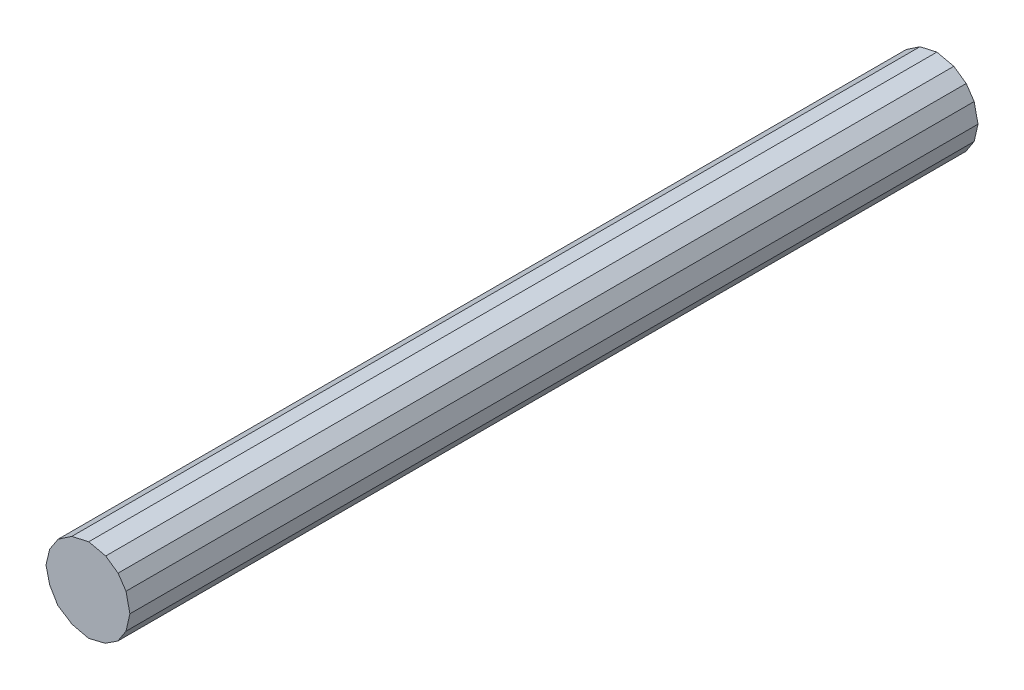
ISO-10303-21;
HEADER;
FILE_DESCRIPTION(('STEP AP214'),'2;1');
FILE_NAME('part.step','',(''),(''),'','','');
FILE_SCHEMA(('AUTOMOTIVE_DESIGN { 1 0 10303 214 1 1 1 1 }'));
ENDSEC;
DATA;
#1=APPLICATION_CONTEXT('core data for automotive mechanical design processes');
#2=APPLICATION_PROTOCOL_DEFINITION('international standard','automotive_design',2000,#1);
#3=PRODUCT_CONTEXT('',#1,'mechanical');
#4=PRODUCT('Part','Part','',(#3));
#5=PRODUCT_RELATED_PRODUCT_CATEGORY('part','',(#4));
#6=PRODUCT_DEFINITION_FORMATION('','',#4);
#7=PRODUCT_DEFINITION_CONTEXT('part definition',#1,'design');
#8=PRODUCT_DEFINITION('design','',#6,#7);
#9=PRODUCT_DEFINITION_SHAPE('','',#8);
#10=(LENGTH_UNIT() NAMED_UNIT(*) SI_UNIT(.MILLI.,.METRE.));
#11=(NAMED_UNIT(*) PLANE_ANGLE_UNIT() SI_UNIT($,.RADIAN.));
#12=(NAMED_UNIT(*) SI_UNIT($,.STERADIAN.) SOLID_ANGLE_UNIT());
#13=UNCERTAINTY_MEASURE_WITH_UNIT(LENGTH_MEASURE(1.E-05),#10,'distance_accuracy_value','');
#14=(GEOMETRIC_REPRESENTATION_CONTEXT(3) GLOBAL_UNCERTAINTY_ASSIGNED_CONTEXT((#13)) GLOBAL_UNIT_ASSIGNED_CONTEXT((#10,
#11,#12)) REPRESENTATION_CONTEXT('',''));
#15=CARTESIAN_POINT('',(0.,0.,0.));
#16=DIRECTION('',(0.,0.,1.));
#17=DIRECTION('',(1.,0.,0.));
#18=AXIS2_PLACEMENT_3D('',#15,#16,#17);
#19=CARTESIAN_POINT('',(-0.5050663,-0.1985264,11.20000046));
#20=DIRECTION('',(0.,0.,1.));
#21=DIRECTION('',(1.,0.,0.));
#22=AXIS2_PLACEMENT_3D('',#19,#20,#21);
#23=PLANE('',#22);
#24=DIRECTION('',(-0.231653218119011,0.972798430578044,0.));
#25=VECTOR('',#24,1.);
#26=CARTESIAN_POINT('',(-0.5050663,-0.1985264,11.20000046));
#27=LINE('',#26,#25);
#28=CARTESIAN_POINT('',(-0.5050663,-0.1985264,11.20000046));
#29=VERTEX_POINT('',#28);
#30=CARTESIAN_POINT('',(-0.5537327,0.005841999999999,11.20000046));
#31=VERTEX_POINT('',#30);
#32=EDGE_CURVE('E224',#29,#31,#27,.T.);
#33=ORIENTED_EDGE('',*,*,#32,.F.);
#34=DIRECTION('',(-0.508961233063914,0.860789441871855,0.));
#35=VECTOR('',#34,1.);
#36=CARTESIAN_POINT('',(-0.3980307,-0.3795522,11.20000046));
#37=LINE('',#36,#35);
#38=CARTESIAN_POINT('',(-0.3980307,-0.3795522,11.20000046));
#39=VERTEX_POINT('',#38);
#40=EDGE_CURVE('E27',#39,#29,#37,.T.);
#41=ORIENTED_EDGE('',*,*,#40,.F.);
#42=DIRECTION('',(-0.842148036657239,0.539246404118153,0.));
#43=VECTOR('',#42,1.);
#44=CARTESIAN_POINT('',(-0.2248027,-0.490474,11.20000046));
#45=LINE('',#44,#43);
#46=CARTESIAN_POINT('',(-0.2248027,-0.490474,11.20000046));
#47=VERTEX_POINT('',#46);
#48=EDGE_CURVE('E109',#47,#39,#45,.T.);
#49=ORIENTED_EDGE('',*,*,#48,.F.);
#50=DIRECTION('',(-0.707106781186548,0.707106781186548,0.));
#51=VECTOR('',#50,1.);
#52=CARTESIAN_POINT('',(-0.2150491,-0.5002276,11.20000046));
#53=LINE('',#52,#51);
#54=CARTESIAN_POINT('',(-0.2150491,-0.5002276,11.20000046));
#55=VERTEX_POINT('',#54);
#56=EDGE_CURVE('E21',#55,#47,#53,.T.);
#57=ORIENTED_EDGE('',*,*,#56,.F.);
#58=DIRECTION('',(-0.973544536039774,0.228497344288947,0.));
#59=VECTOR('',#58,1.);
#60=CARTESIAN_POINT('',(0.0087503,-0.5527548,11.20000046));
#61=LINE('',#60,#59);
#62=CARTESIAN_POINT('',(0.0087503,-0.5527548,11.20000046));
#63=VERTEX_POINT('',#62);
#64=EDGE_CURVE('E230',#63,#55,#61,.T.);
#65=ORIENTED_EDGE('',*,*,#64,.F.);
#66=DIRECTION('',(-0.972173014602938,-0.234264017035985,0.));
#67=VECTOR('',#66,1.);
#68=CARTESIAN_POINT('',(0.2267331,-0.5002276,11.20000046));
#69=LINE('',#68,#67);
#70=CARTESIAN_POINT('',(0.2267331,-0.5002276,11.20000046));
#71=VERTEX_POINT('',#70);
#72=EDGE_CURVE('E249',#71,#63,#69,.T.);
#73=ORIENTED_EDGE('',*,*,#72,.F.);
#74=DIRECTION('',(-0.837987268129986,-0.545689782249991,0.));
#75=VECTOR('',#74,1.);
#76=CARTESIAN_POINT('',(0.3941445,-0.3912108,11.20000046));
#77=LINE('',#76,#75);
#78=CARTESIAN_POINT('',(0.3941445,-0.3912108,11.20000046));
#79=VERTEX_POINT('',#78);
#80=EDGE_CURVE('E259',#79,#71,#77,.T.);
#81=ORIENTED_EDGE('',*,*,#80,.F.);
#82=DIRECTION('',(-0.545658634243012,-0.838007550608019,0.));
#83=VECTOR('',#82,1.);
#84=CARTESIAN_POINT('',(0.5031359,-0.2238248,11.20000046));
#85=LINE('',#84,#83);
#86=CARTESIAN_POINT('',(0.5031359,-0.2238248,11.20000046));
#87=VERTEX_POINT('',#86);
#88=EDGE_CURVE('E235',#87,#79,#85,.T.);
#89=ORIENTED_EDGE('',*,*,#88,.F.);
#90=DIRECTION('',(-0.220491886816933,-0.975388808551702,0.));
#91=VECTOR('',#90,1.);
#92=CARTESIAN_POINT('',(0.5537327,0.,11.20000046));
#93=LINE('',#92,#91);
#94=CARTESIAN_POINT('',(0.5537327,0.,11.20000046));
#95=VERTEX_POINT('',#94);
#96=EDGE_CURVE('E218',#95,#87,#93,.T.);
#97=ORIENTED_EDGE('',*,*,#96,.F.);
#98=DIRECTION('',(0.211727966137,-0.977328638870001,0.));
#99=VECTOR('',#98,1.);
#100=CARTESIAN_POINT('',(0.5031359,0.233553,11.20000046));
#101=LINE('',#100,#99);
#102=CARTESIAN_POINT('',(0.5031359,0.233553,11.20000046));
#103=VERTEX_POINT('',#102);
#104=EDGE_CURVE('E164',#103,#95,#101,.T.);
#105=ORIENTED_EDGE('',*,*,#104,.F.);
#106=DIRECTION('',(0.564292757689139,-0.825574759558204,0.));
#107=VECTOR('',#106,1.);
#108=CARTESIAN_POINT('',(0.3980307,0.3873246,11.20000046));
#109=LINE('',#108,#107);
#110=CARTESIAN_POINT('',(0.3980307,0.3873246,11.20000046));
#111=VERTEX_POINT('',#110);
#112=EDGE_CURVE('E159',#111,#103,#109,.T.);
#113=ORIENTED_EDGE('',*,*,#112,.F.);
#114=DIRECTION('',(0.818329059800928,-0.57474998902595,0.));
#115=VECTOR('',#114,1.);
#116=CARTESIAN_POINT('',(0.2345309,0.502158,11.20000046));
#117=LINE('',#116,#115);
#118=CARTESIAN_POINT('',(0.2345309,0.502158,11.20000046));
#119=VERTEX_POINT('',#118);
#120=EDGE_CURVE('E162',#119,#111,#117,.T.);
#121=ORIENTED_EDGE('',*,*,#120,.F.);
#122=DIRECTION('',(0.975388808551702,-0.220491886816933,0.));
#123=VECTOR('',#122,1.);
#124=CARTESIAN_POINT('',(0.0107061,0.5527548,11.20000046));
#125=LINE('',#124,#123);
#126=CARTESIAN_POINT('',(0.0107061,0.5527548,11.20000046));
#127=VERTEX_POINT('',#126);
#128=EDGE_CURVE('E208',#127,#119,#125,.T.);
#129=ORIENTED_EDGE('',*,*,#128,.F.);
#130=DIRECTION('',(0.975388808551702,0.220491886816933,0.));
#131=VECTOR('',#130,1.);
#132=CARTESIAN_POINT('',(-0.2131187,0.502158,11.20000046));
#133=LINE('',#132,#131);
#134=CARTESIAN_POINT('',(-0.2131187,0.502158,11.20000046));
#135=VERTEX_POINT('',#134);
#136=EDGE_CURVE('E264',#135,#127,#133,.T.);
#137=ORIENTED_EDGE('',*,*,#136,.F.);
#138=DIRECTION('',(0.827880404697028,0.560904658136019,0.));
#139=VECTOR('',#138,1.);
#140=CARTESIAN_POINT('',(-0.3941191,0.3795268,11.20000046));
#141=LINE('',#140,#139);
#142=CARTESIAN_POINT('',(-0.3941191,0.3795268,11.20000046));
#143=VERTEX_POINT('',#142);
#144=EDGE_CURVE('E244',#143,#135,#141,.T.);
#145=ORIENTED_EDGE('',*,*,#144,.F.);
#146=DIRECTION('',(0.548080747546029,0.836425426544044,0.));
#147=VECTOR('',#146,1.);
#148=CARTESIAN_POINT('',(-0.5050663,0.2102104,11.20000046));
#149=LINE('',#148,#147);
#150=CARTESIAN_POINT('',(-0.5050663,0.2102104,11.20000046));
#151=VERTEX_POINT('',#150);
#152=EDGE_CURVE('E191',#151,#143,#149,.T.);
#153=ORIENTED_EDGE('',*,*,#152,.F.);
#154=DIRECTION('',(0.231653218119011,0.972798430578044,0.));
#155=VECTOR('',#154,1.);
#156=CARTESIAN_POINT('',(-0.5537327,0.005841999999999,11.20000046));
#157=LINE('',#156,#155);
#158=EDGE_CURVE('E197',#31,#151,#157,.T.);
#159=ORIENTED_EDGE('',*,*,#158,.F.);
#160=EDGE_LOOP('',(#33,#41,#49,#57,#65,#73,#81,#89,#97,#105,#113,#121,#129,#137,#145,#153,#159));
#161=FACE_BOUND('',#160,.T.);
#162=ADVANCED_FACE('F17',(#161),#23,.T.);
#163=CARTESIAN_POINT('',(-0.5050663,-0.1985264,0.));
#164=DIRECTION('',(0.,0.,1.));
#165=DIRECTION('',(1.,0.,0.));
#166=AXIS2_PLACEMENT_3D('',#163,#164,#165);
#167=PLANE('',#166);
#168=DIRECTION('',(-0.231653218119011,0.972798430578044,0.));
#169=VECTOR('',#168,1.);
#170=CARTESIAN_POINT('',(-0.5050663,-0.1985264,0.));
#171=LINE('',#170,#169);
#172=CARTESIAN_POINT('',(-0.5050663,-0.1985264,0.));
#173=VERTEX_POINT('',#172);
#174=CARTESIAN_POINT('',(-0.5537327,0.005841999999999,0.));
#175=VERTEX_POINT('',#174);
#176=EDGE_CURVE('E193',#173,#175,#171,.T.);
#177=ORIENTED_EDGE('',*,*,#176,.T.);
#178=DIRECTION('',(0.231653218119011,0.972798430578044,0.));
#179=VECTOR('',#178,1.);
#180=CARTESIAN_POINT('',(-0.5537327,0.005841999999999,0.));
#181=LINE('',#180,#179);
#182=CARTESIAN_POINT('',(-0.5050663,0.2102104,0.));
#183=VERTEX_POINT('',#182);
#184=EDGE_CURVE('E276',#175,#183,#181,.T.);
#185=ORIENTED_EDGE('',*,*,#184,.T.);
#186=DIRECTION('',(0.548080747546029,0.836425426544044,0.));
#187=VECTOR('',#186,1.);
#188=CARTESIAN_POINT('',(-0.5050663,0.2102104,0.));
#189=LINE('',#188,#187);
#190=CARTESIAN_POINT('',(-0.3941191,0.3795268,0.));
#191=VERTEX_POINT('',#190);
#192=EDGE_CURVE('E213',#183,#191,#189,.T.);
#193=ORIENTED_EDGE('',*,*,#192,.T.);
#194=DIRECTION('',(0.827880404697028,0.560904658136019,0.));
#195=VECTOR('',#194,1.);
#196=CARTESIAN_POINT('',(-0.3941191,0.3795268,0.));
#197=LINE('',#196,#195);
#198=CARTESIAN_POINT('',(-0.2131187,0.502158,0.));
#199=VERTEX_POINT('',#198);
#200=EDGE_CURVE('E260',#191,#199,#197,.T.);
#201=ORIENTED_EDGE('',*,*,#200,.T.);
#202=DIRECTION('',(0.975388808551702,0.220491886816933,0.));
#203=VECTOR('',#202,1.);
#204=CARTESIAN_POINT('',(-0.2131187,0.502158,0.));
#205=LINE('',#204,#203);
#206=CARTESIAN_POINT('',(0.0107061,0.5527548,0.));
#207=VERTEX_POINT('',#206);
#208=EDGE_CURVE('E265',#199,#207,#205,.T.);
#209=ORIENTED_EDGE('',*,*,#208,.T.);
#210=DIRECTION('',(0.975388808551702,-0.220491886816933,0.));
#211=VECTOR('',#210,1.);
#212=CARTESIAN_POINT('',(0.0107061,0.5527548,0.));
#213=LINE('',#212,#211);
#214=CARTESIAN_POINT('',(0.2345309,0.502158,0.));
#215=VERTEX_POINT('',#214);
#216=EDGE_CURVE('E182',#207,#215,#213,.T.);
#217=ORIENTED_EDGE('',*,*,#216,.T.);
#218=DIRECTION('',(0.818329059800928,-0.57474998902595,0.));
#219=VECTOR('',#218,1.);
#220=CARTESIAN_POINT('',(0.2345309,0.502158,0.));
#221=LINE('',#220,#219);
#222=CARTESIAN_POINT('',(0.3980307,0.3873246,0.));
#223=VERTEX_POINT('',#222);
#224=EDGE_CURVE('E153',#215,#223,#221,.T.);
#225=ORIENTED_EDGE('',*,*,#224,.T.);
#226=DIRECTION('',(0.564292757689139,-0.825574759558204,0.));
#227=VECTOR('',#226,1.);
#228=CARTESIAN_POINT('',(0.3980307,0.3873246,0.));
#229=LINE('',#228,#227);
#230=CARTESIAN_POINT('',(0.5031359,0.233553,0.));
#231=VERTEX_POINT('',#230);
#232=EDGE_CURVE('E174',#223,#231,#229,.T.);
#233=ORIENTED_EDGE('',*,*,#232,.T.);
#234=DIRECTION('',(0.211727966137,-0.977328638870001,0.));
#235=VECTOR('',#234,1.);
#236=CARTESIAN_POINT('',(0.5031359,0.233553,0.));
#237=LINE('',#236,#235);
#238=CARTESIAN_POINT('',(0.5537327,0.,0.));
#239=VERTEX_POINT('',#238);
#240=EDGE_CURVE('E214',#231,#239,#237,.T.);
#241=ORIENTED_EDGE('',*,*,#240,.T.);
#242=DIRECTION('',(-0.220491886816933,-0.975388808551702,0.));
#243=VECTOR('',#242,1.);
#244=CARTESIAN_POINT('',(0.5537327,0.,0.));
#245=LINE('',#244,#243);
#246=CARTESIAN_POINT('',(0.5031359,-0.2238248,0.));
#247=VERTEX_POINT('',#246);
#248=EDGE_CURVE('E231',#239,#247,#245,.T.);
#249=ORIENTED_EDGE('',*,*,#248,.T.);
#250=DIRECTION('',(-0.545658634243012,-0.838007550608019,0.));
#251=VECTOR('',#250,1.);
#252=CARTESIAN_POINT('',(0.5031359,-0.2238248,0.));
#253=LINE('',#252,#251);
#254=CARTESIAN_POINT('',(0.3941445,-0.3912108,0.));
#255=VERTEX_POINT('',#254);
#256=EDGE_CURVE('E255',#247,#255,#253,.T.);
#257=ORIENTED_EDGE('',*,*,#256,.T.);
#258=DIRECTION('',(-0.837987268129986,-0.545689782249991,0.));
#259=VECTOR('',#258,1.);
#260=CARTESIAN_POINT('',(0.3941445,-0.3912108,0.));
#261=LINE('',#260,#259);
#262=CARTESIAN_POINT('',(0.2267331,-0.5002276,0.));
#263=VERTEX_POINT('',#262);
#264=EDGE_CURVE('E254',#255,#263,#261,.T.);
#265=ORIENTED_EDGE('',*,*,#264,.T.);
#266=DIRECTION('',(-0.972173014602938,-0.234264017035985,0.));
#267=VECTOR('',#266,1.);
#268=CARTESIAN_POINT('',(0.2267331,-0.5002276,0.));
#269=LINE('',#268,#267);
#270=CARTESIAN_POINT('',(0.0087503,-0.5527548,0.));
#271=VERTEX_POINT('',#270);
#272=EDGE_CURVE('E292',#263,#271,#269,.T.);
#273=ORIENTED_EDGE('',*,*,#272,.T.);
#274=DIRECTION('',(-0.973544536039774,0.228497344288947,0.));
#275=VECTOR('',#274,1.);
#276=CARTESIAN_POINT('',(0.0087503,-0.5527548,0.));
#277=LINE('',#276,#275);
#278=CARTESIAN_POINT('',(-0.2150491,-0.5002276,0.));
#279=VERTEX_POINT('',#278);
#280=EDGE_CURVE('E229',#271,#279,#277,.T.);
#281=ORIENTED_EDGE('',*,*,#280,.T.);
#282=DIRECTION('',(-0.707106781186548,0.707106781186548,0.));
#283=VECTOR('',#282,1.);
#284=CARTESIAN_POINT('',(-0.2150491,-0.5002276,0.));
#285=LINE('',#284,#283);
#286=CARTESIAN_POINT('',(-0.2248027,-0.490474,0.));
#287=VERTEX_POINT('',#286);
#288=EDGE_CURVE('E121',#279,#287,#285,.T.);
#289=ORIENTED_EDGE('',*,*,#288,.T.);
#290=DIRECTION('',(-0.842148036657239,0.539246404118153,0.));
#291=VECTOR('',#290,1.);
#292=CARTESIAN_POINT('',(-0.2248027,-0.490474,0.));
#293=LINE('',#292,#291);
#294=CARTESIAN_POINT('',(-0.3980307,-0.3795522,0.));
#295=VERTEX_POINT('',#294);
#296=EDGE_CURVE('E296',#287,#295,#293,.T.);
#297=ORIENTED_EDGE('',*,*,#296,.T.);
#298=DIRECTION('',(-0.508961233063914,0.860789441871855,0.));
#299=VECTOR('',#298,1.);
#300=CARTESIAN_POINT('',(-0.3980307,-0.3795522,0.));
#301=LINE('',#300,#299);
#302=EDGE_CURVE('E11',#295,#173,#301,.T.);
#303=ORIENTED_EDGE('',*,*,#302,.T.);
#304=EDGE_LOOP('',(#177,#185,#193,#201,#209,#217,#225,#233,#241,#249,#257,#265,#273,#281,#289,
#297,#303));
#305=FACE_BOUND('',#304,.T.);
#306=ADVANCED_FACE('F332',(#305),#167,.F.);
#307=CARTESIAN_POINT('',(-0.3980307,-0.3795522,0.));
#308=DIRECTION('',(-0.860789441871855,-0.508961233063914,0.));
#309=DIRECTION('',(-0.508961233063914,0.860789441871855,0.));
#310=AXIS2_PLACEMENT_3D('',#307,#308,#309);
#311=PLANE('',#310);
#312=DIRECTION('',(0.,0.,1.));
#313=VECTOR('',#312,1.);
#314=CARTESIAN_POINT('',(-0.3980307,-0.3795522,0.));
#315=LINE('',#314,#313);
#316=EDGE_CURVE('E299',#295,#39,#315,.T.);
#317=ORIENTED_EDGE('',*,*,#316,.T.);
#318=ORIENTED_EDGE('',*,*,#40,.T.);
#319=DIRECTION('',(0.,0.,1.));
#320=VECTOR('',#319,1.);
#321=CARTESIAN_POINT('',(-0.5050663,-0.1985264,0.));
#322=LINE('',#321,#320);
#323=EDGE_CURVE('E300',#173,#29,#322,.T.);
#324=ORIENTED_EDGE('',*,*,#323,.F.);
#325=ORIENTED_EDGE('',*,*,#302,.F.);
#326=EDGE_LOOP('',(#317,#318,#324,#325));
#327=FACE_BOUND('',#326,.T.);
#328=ADVANCED_FACE('F19',(#327),#311,.T.);
#329=CARTESIAN_POINT('',(-0.2248027,-0.490474,0.));
#330=DIRECTION('',(-0.539246404118153,-0.842148036657239,0.));
#331=DIRECTION('',(-0.842148036657239,0.539246404118153,0.));
#332=AXIS2_PLACEMENT_3D('',#329,#330,#331);
#333=PLANE('',#332);
#334=DIRECTION('',(0.,0.,1.));
#335=VECTOR('',#334,1.);
#336=CARTESIAN_POINT('',(-0.2248027,-0.490474,0.));
#337=LINE('',#336,#335);
#338=EDGE_CURVE('E201',#287,#47,#337,.T.);
#339=ORIENTED_EDGE('',*,*,#338,.T.);
#340=ORIENTED_EDGE('',*,*,#48,.T.);
#341=ORIENTED_EDGE('',*,*,#316,.F.);
#342=ORIENTED_EDGE('',*,*,#296,.F.);
#343=EDGE_LOOP('',(#339,#340,#341,#342));
#344=FACE_BOUND('',#343,.T.);
#345=ADVANCED_FACE('F339',(#344),#333,.T.);
#346=CARTESIAN_POINT('',(-0.2150491,-0.5002276,0.));
#347=DIRECTION('',(-0.707106781186548,-0.707106781186548,0.));
#348=DIRECTION('',(-0.707106781186548,0.707106781186548,0.));
#349=AXIS2_PLACEMENT_3D('',#346,#347,#348);
#350=PLANE('',#349);
#351=DIRECTION('',(0.,0.,1.));
#352=VECTOR('',#351,1.);
#353=CARTESIAN_POINT('',(-0.2150491,-0.5002276,0.));
#354=LINE('',#353,#352);
#355=EDGE_CURVE('E226',#279,#55,#354,.T.);
#356=ORIENTED_EDGE('',*,*,#355,.T.);
#357=ORIENTED_EDGE('',*,*,#56,.T.);
#358=ORIENTED_EDGE('',*,*,#338,.F.);
#359=ORIENTED_EDGE('',*,*,#288,.F.);
#360=EDGE_LOOP('',(#356,#357,#358,#359));
#361=FACE_BOUND('',#360,.T.);
#362=ADVANCED_FACE('F690',(#361),#350,.T.);
#363=CARTESIAN_POINT('',(0.0087503,-0.5527548,0.));
#364=DIRECTION('',(-0.228497344288947,-0.973544536039774,0.));
#365=DIRECTION('',(-0.973544536039774,0.228497344288947,0.));
#366=AXIS2_PLACEMENT_3D('',#363,#364,#365);
#367=PLANE('',#366);
#368=DIRECTION('',(0.,0.,1.));
#369=VECTOR('',#368,1.);
#370=CARTESIAN_POINT('',(0.0087503,-0.5527548,0.));
#371=LINE('',#370,#369);
#372=EDGE_CURVE('E253',#271,#63,#371,.T.);
#373=ORIENTED_EDGE('',*,*,#372,.T.);
#374=ORIENTED_EDGE('',*,*,#64,.T.);
#375=ORIENTED_EDGE('',*,*,#355,.F.);
#376=ORIENTED_EDGE('',*,*,#280,.F.);
#377=EDGE_LOOP('',(#373,#374,#375,#376));
#378=FACE_BOUND('',#377,.T.);
#379=ADVANCED_FACE('F681',(#378),#367,.T.);
#380=CARTESIAN_POINT('',(0.2267331,-0.5002276,0.));
#381=DIRECTION('',(0.234264017035985,-0.972173014602938,0.));
#382=DIRECTION('',(0.,0.,-1.));
#383=AXIS2_PLACEMENT_3D('',#380,#381,#382);
#384=PLANE('',#383);
#385=DIRECTION('',(0.,0.,1.));
#386=VECTOR('',#385,1.);
#387=CARTESIAN_POINT('',(0.2267331,-0.5002276,0.));
#388=LINE('',#387,#386);
#389=EDGE_CURVE('E286',#263,#71,#388,.T.);
#390=ORIENTED_EDGE('',*,*,#389,.T.);
#391=ORIENTED_EDGE('',*,*,#72,.T.);
#392=ORIENTED_EDGE('',*,*,#372,.F.);
#393=ORIENTED_EDGE('',*,*,#272,.F.);
#394=EDGE_LOOP('',(#390,#391,#392,#393));
#395=FACE_BOUND('',#394,.T.);
#396=ADVANCED_FACE('F673',(#395),#384,.T.);
#397=CARTESIAN_POINT('',(0.3941445,-0.3912108,0.));
#398=DIRECTION('',(0.545689782249991,-0.837987268129986,0.));
#399=DIRECTION('',(0.,0.,-1.));
#400=AXIS2_PLACEMENT_3D('',#397,#398,#399);
#401=PLANE('',#400);
#402=DIRECTION('',(0.,0.,1.));
#403=VECTOR('',#402,1.);
#404=CARTESIAN_POINT('',(0.3941445,-0.3912108,0.));
#405=LINE('',#404,#403);
#406=EDGE_CURVE('E243',#255,#79,#405,.T.);
#407=ORIENTED_EDGE('',*,*,#406,.T.);
#408=ORIENTED_EDGE('',*,*,#80,.T.);
#409=ORIENTED_EDGE('',*,*,#389,.F.);
#410=ORIENTED_EDGE('',*,*,#264,.F.);
#411=EDGE_LOOP('',(#407,#408,#409,#410));
#412=FACE_BOUND('',#411,.T.);
#413=ADVANCED_FACE('F665',(#412),#401,.T.);
#414=CARTESIAN_POINT('',(0.5031359,-0.2238248,0.));
#415=DIRECTION('',(0.838007550608019,-0.545658634243012,0.));
#416=DIRECTION('',(0.,0.,-1.));
#417=AXIS2_PLACEMENT_3D('',#414,#415,#416);
#418=PLANE('',#417);
#419=DIRECTION('',(0.,0.,1.));
#420=VECTOR('',#419,1.);
#421=CARTESIAN_POINT('',(0.5031359,-0.2238248,0.));
#422=LINE('',#421,#420);
#423=EDGE_CURVE('E236',#247,#87,#422,.T.);
#424=ORIENTED_EDGE('',*,*,#423,.T.);
#425=ORIENTED_EDGE('',*,*,#88,.T.);
#426=ORIENTED_EDGE('',*,*,#406,.F.);
#427=ORIENTED_EDGE('',*,*,#256,.F.);
#428=EDGE_LOOP('',(#424,#425,#426,#427));
#429=FACE_BOUND('',#428,.T.);
#430=ADVANCED_FACE('F418',(#429),#418,.T.);
#431=CARTESIAN_POINT('',(0.5537327,0.,0.));
#432=DIRECTION('',(0.975388808551702,-0.220491886816933,0.));
#433=DIRECTION('',(0.,0.,-1.));
#434=AXIS2_PLACEMENT_3D('',#431,#432,#433);
#435=PLANE('',#434);
#436=DIRECTION('',(0.,0.,1.));
#437=VECTOR('',#436,1.);
#438=CARTESIAN_POINT('',(0.5537327,0.,0.));
#439=LINE('',#438,#437);
#440=EDGE_CURVE('E219',#239,#95,#439,.T.);
#441=ORIENTED_EDGE('',*,*,#440,.T.);
#442=ORIENTED_EDGE('',*,*,#96,.T.);
#443=ORIENTED_EDGE('',*,*,#423,.F.);
#444=ORIENTED_EDGE('',*,*,#248,.F.);
#445=EDGE_LOOP('',(#441,#442,#443,#444));
#446=FACE_BOUND('',#445,.T.);
#447=ADVANCED_FACE('F416',(#446),#435,.T.);
#448=CARTESIAN_POINT('',(0.5031359,0.233553,0.));
#449=DIRECTION('',(0.977328638870001,0.211727966137,0.));
#450=DIRECTION('',(0.,0.,-1.));
#451=AXIS2_PLACEMENT_3D('',#448,#449,#450);
#452=PLANE('',#451);
#453=DIRECTION('',(0.,0.,1.));
#454=VECTOR('',#453,1.);
#455=CARTESIAN_POINT('',(0.5031359,0.233553,0.));
#456=LINE('',#455,#454);
#457=EDGE_CURVE('E169',#231,#103,#456,.T.);
#458=ORIENTED_EDGE('',*,*,#457,.T.);
#459=ORIENTED_EDGE('',*,*,#104,.T.);
#460=ORIENTED_EDGE('',*,*,#440,.F.);
#461=ORIENTED_EDGE('',*,*,#240,.F.);
#462=EDGE_LOOP('',(#458,#459,#460,#461));
#463=FACE_BOUND('',#462,.T.);
#464=ADVANCED_FACE('F411',(#463),#452,.T.);
#465=CARTESIAN_POINT('',(0.3980307,0.3873246,0.));
#466=DIRECTION('',(0.825574759558204,0.564292757689139,0.));
#467=DIRECTION('',(0.,0.,-1.));
#468=AXIS2_PLACEMENT_3D('',#465,#466,#467);
#469=PLANE('',#468);
#470=DIRECTION('',(0.,0.,1.));
#471=VECTOR('',#470,1.);
#472=CARTESIAN_POINT('',(0.3980307,0.3873246,0.));
#473=LINE('',#472,#471);
#474=EDGE_CURVE('E171',#223,#111,#473,.T.);
#475=ORIENTED_EDGE('',*,*,#474,.T.);
#476=ORIENTED_EDGE('',*,*,#112,.T.);
#477=ORIENTED_EDGE('',*,*,#457,.F.);
#478=ORIENTED_EDGE('',*,*,#232,.F.);
#479=EDGE_LOOP('',(#475,#476,#477,#478));
#480=FACE_BOUND('',#479,.T.);
#481=ADVANCED_FACE('F172',(#480),#469,.T.);
#482=CARTESIAN_POINT('',(0.2345309,0.502158,0.));
#483=DIRECTION('',(0.57474998902595,0.818329059800928,0.));
#484=DIRECTION('',(0.,0.,-1.));
#485=AXIS2_PLACEMENT_3D('',#482,#483,#484);
#486=PLANE('',#485);
#487=DIRECTION('',(0.,0.,1.));
#488=VECTOR('',#487,1.);
#489=CARTESIAN_POINT('',(0.2345309,0.502158,0.));
#490=LINE('',#489,#488);
#491=EDGE_CURVE('E179',#215,#119,#490,.T.);
#492=ORIENTED_EDGE('',*,*,#491,.T.);
#493=ORIENTED_EDGE('',*,*,#120,.T.);
#494=ORIENTED_EDGE('',*,*,#474,.F.);
#495=ORIENTED_EDGE('',*,*,#224,.F.);
#496=EDGE_LOOP('',(#492,#493,#494,#495));
#497=FACE_BOUND('',#496,.T.);
#498=ADVANCED_FACE('F177',(#497),#486,.T.);
#499=CARTESIAN_POINT('',(0.0107061,0.5527548,0.));
#500=DIRECTION('',(0.220491886816933,0.975388808551702,0.));
#501=DIRECTION('',(0.,0.,-1.));
#502=AXIS2_PLACEMENT_3D('',#499,#500,#501);
#503=PLANE('',#502);
#504=DIRECTION('',(0.,0.,1.));
#505=VECTOR('',#504,1.);
#506=CARTESIAN_POINT('',(0.0107061,0.5527548,0.));
#507=LINE('',#506,#505);
#508=EDGE_CURVE('E268',#207,#127,#507,.T.);
#509=ORIENTED_EDGE('',*,*,#508,.T.);
#510=ORIENTED_EDGE('',*,*,#128,.T.);
#511=ORIENTED_EDGE('',*,*,#491,.F.);
#512=ORIENTED_EDGE('',*,*,#216,.F.);
#513=EDGE_LOOP('',(#509,#510,#511,#512));
#514=FACE_BOUND('',#513,.T.);
#515=ADVANCED_FACE('F379',(#514),#503,.T.);
#516=CARTESIAN_POINT('',(-0.2131187,0.502158,0.));
#517=DIRECTION('',(-0.220491886816933,0.975388808551702,0.));
#518=DIRECTION('',(0.,0.,1.));
#519=AXIS2_PLACEMENT_3D('',#516,#517,#518);
#520=PLANE('',#519);
#521=DIRECTION('',(0.,0.,1.));
#522=VECTOR('',#521,1.);
#523=CARTESIAN_POINT('',(-0.2131187,0.502158,0.));
#524=LINE('',#523,#522);
#525=EDGE_CURVE('E248',#199,#135,#524,.T.);
#526=ORIENTED_EDGE('',*,*,#525,.T.);
#527=ORIENTED_EDGE('',*,*,#136,.T.);
#528=ORIENTED_EDGE('',*,*,#508,.F.);
#529=ORIENTED_EDGE('',*,*,#208,.F.);
#530=EDGE_LOOP('',(#526,#527,#528,#529));
#531=FACE_BOUND('',#530,.T.);
#532=ADVANCED_FACE('F373',(#531),#520,.T.);
#533=CARTESIAN_POINT('',(-0.3941191,0.3795268,0.));
#534=DIRECTION('',(-0.560904658136019,0.827880404697028,0.));
#535=DIRECTION('',(0.,0.,1.));
#536=AXIS2_PLACEMENT_3D('',#533,#534,#535);
#537=PLANE('',#536);
#538=DIRECTION('',(0.,0.,1.));
#539=VECTOR('',#538,1.);
#540=CARTESIAN_POINT('',(-0.3941191,0.3795268,0.));
#541=LINE('',#540,#539);
#542=EDGE_CURVE('E209',#191,#143,#541,.T.);
#543=ORIENTED_EDGE('',*,*,#542,.T.);
#544=ORIENTED_EDGE('',*,*,#144,.T.);
#545=ORIENTED_EDGE('',*,*,#525,.F.);
#546=ORIENTED_EDGE('',*,*,#200,.F.);
#547=EDGE_LOOP('',(#543,#544,#545,#546));
#548=FACE_BOUND('',#547,.T.);
#549=ADVANCED_FACE('F597',(#548),#537,.T.);
#550=CARTESIAN_POINT('',(-0.5050663,0.2102104,0.));
#551=DIRECTION('',(-0.836425426544044,0.548080747546029,0.));
#552=DIRECTION('',(0.,0.,1.));
#553=AXIS2_PLACEMENT_3D('',#550,#551,#552);
#554=PLANE('',#553);
#555=DIRECTION('',(0.,0.,1.));
#556=VECTOR('',#555,1.);
#557=CARTESIAN_POINT('',(-0.5050663,0.2102104,0.));
#558=LINE('',#557,#556);
#559=EDGE_CURVE('E273',#183,#151,#558,.T.);
#560=ORIENTED_EDGE('',*,*,#559,.T.);
#561=ORIENTED_EDGE('',*,*,#152,.T.);
#562=ORIENTED_EDGE('',*,*,#542,.F.);
#563=ORIENTED_EDGE('',*,*,#192,.F.);
#564=EDGE_LOOP('',(#560,#561,#562,#563));
#565=FACE_BOUND('',#564,.T.);
#566=ADVANCED_FACE('F587',(#565),#554,.T.);
#567=CARTESIAN_POINT('',(-0.5537327,0.005841999999999,0.));
#568=DIRECTION('',(-0.972798430578044,0.231653218119011,0.));
#569=DIRECTION('',(0.,0.,1.));
#570=AXIS2_PLACEMENT_3D('',#567,#568,#569);
#571=PLANE('',#570);
#572=DIRECTION('',(0.,0.,1.));
#573=VECTOR('',#572,1.);
#574=CARTESIAN_POINT('',(-0.5537327,0.005841999999999,0.));
#575=LINE('',#574,#573);
#576=EDGE_CURVE('E198',#175,#31,#575,.T.);
#577=ORIENTED_EDGE('',*,*,#576,.T.);
#578=ORIENTED_EDGE('',*,*,#158,.T.);
#579=ORIENTED_EDGE('',*,*,#559,.F.);
#580=ORIENTED_EDGE('',*,*,#184,.F.);
#581=EDGE_LOOP('',(#577,#578,#579,#580));
#582=FACE_BOUND('',#581,.T.);
#583=ADVANCED_FACE('F324',(#582),#571,.T.);
#584=CARTESIAN_POINT('',(-0.5050663,-0.1985264,0.));
#585=DIRECTION('',(-0.972798430578044,-0.231653218119011,0.));
#586=DIRECTION('',(-0.231653218119011,0.972798430578044,0.));
#587=AXIS2_PLACEMENT_3D('',#584,#585,#586);
#588=PLANE('',#587);
#589=ORIENTED_EDGE('',*,*,#323,.T.);
#590=ORIENTED_EDGE('',*,*,#32,.T.);
#591=ORIENTED_EDGE('',*,*,#576,.F.);
#592=ORIENTED_EDGE('',*,*,#176,.F.);
#593=EDGE_LOOP('',(#589,#590,#591,#592));
#594=FACE_BOUND('',#593,.T.);
#595=ADVANCED_FACE('F314',(#594),#588,.T.);
#596=CLOSED_SHELL('',(#162,#306,#328,#345,#362,#379,#396,#413,#430,#447,#464,#481,#498,#515,
#532,#549,#566,#583,#595));
#597=MANIFOLD_SOLID_BREP('B1',#596);
#598=ADVANCED_BREP_SHAPE_REPRESENTATION('',(#18,#597),#14);
#599=SHAPE_DEFINITION_REPRESENTATION(#9,#598);
ENDSEC;
END-ISO-10303-21;
